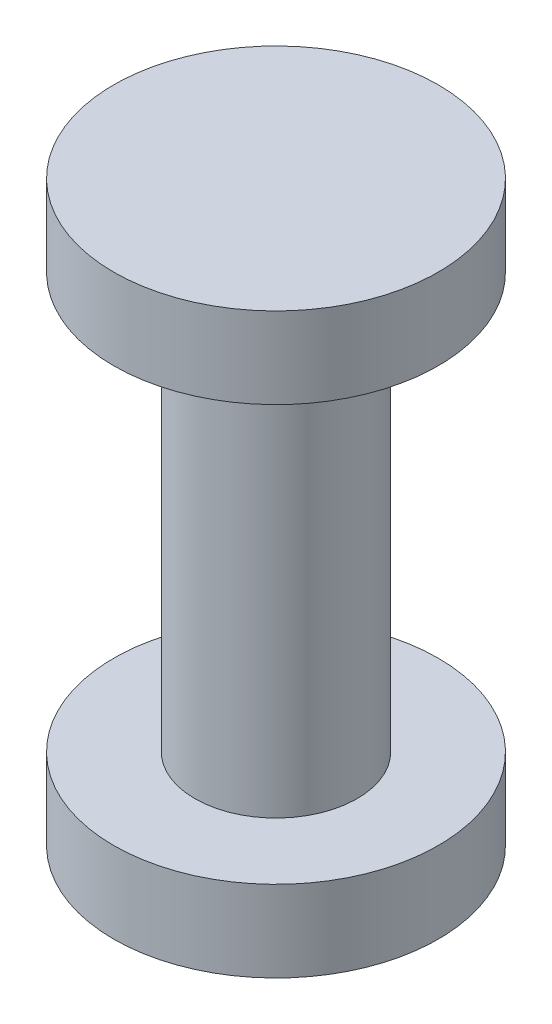
ISO-10303-21;
HEADER;
FILE_DESCRIPTION(('STEP AP214'),'2;1');
FILE_NAME('part.step','',(''),(''),'','','');
FILE_SCHEMA(('AUTOMOTIVE_DESIGN { 1 0 10303 214 1 1 1 1 }'));
ENDSEC;
DATA;
#1=APPLICATION_CONTEXT('core data for automotive mechanical design processes');
#2=APPLICATION_PROTOCOL_DEFINITION('international standard','automotive_design',2000,#1);
#3=PRODUCT_CONTEXT('',#1,'mechanical');
#4=PRODUCT('Part','Part','',(#3));
#5=PRODUCT_RELATED_PRODUCT_CATEGORY('part','',(#4));
#6=PRODUCT_DEFINITION_FORMATION('','',#4);
#7=PRODUCT_DEFINITION_CONTEXT('part definition',#1,'design');
#8=PRODUCT_DEFINITION('design','',#6,#7);
#9=PRODUCT_DEFINITION_SHAPE('','',#8);
#10=(LENGTH_UNIT() NAMED_UNIT(*) SI_UNIT(.MILLI.,.METRE.));
#11=(NAMED_UNIT(*) PLANE_ANGLE_UNIT() SI_UNIT($,.RADIAN.));
#12=(NAMED_UNIT(*) SI_UNIT($,.STERADIAN.) SOLID_ANGLE_UNIT());
#13=UNCERTAINTY_MEASURE_WITH_UNIT(LENGTH_MEASURE(1.E-05),#10,'distance_accuracy_value','');
#14=(GEOMETRIC_REPRESENTATION_CONTEXT(3) GLOBAL_UNCERTAINTY_ASSIGNED_CONTEXT((#13)) GLOBAL_UNIT_ASSIGNED_CONTEXT((#10,
#11,#12)) REPRESENTATION_CONTEXT('',''));
#15=CARTESIAN_POINT('',(0.,0.,0.));
#16=DIRECTION('',(0.,0.,1.));
#17=DIRECTION('',(1.,0.,0.));
#18=AXIS2_PLACEMENT_3D('',#15,#16,#17);
#19=CARTESIAN_POINT('',(0.,12.8,0.));
#20=DIRECTION('',(0.,-1.,0.));
#21=DIRECTION('',(0.,0.,-1.));
#22=AXIS2_PLACEMENT_3D('',#19,#20,#21);
#23=CYLINDRICAL_SURFACE('',#22,2.5);
#24=CARTESIAN_POINT('',(0.,12.8,0.));
#25=DIRECTION('',(0.,1.,0.));
#26=DIRECTION('',(0.,0.,1.));
#27=AXIS2_PLACEMENT_3D('',#24,#25,#26);
#28=CIRCLE('',#27,2.5);
#29=CARTESIAN_POINT('',(0.,12.8,2.5));
#30=VERTEX_POINT('',#29);
#31=EDGE_CURVE('E10',#30,#30,#28,.T.);
#32=ORIENTED_EDGE('',*,*,#31,.F.);
#33=EDGE_LOOP('',(#32));
#34=FACE_BOUND('',#33,.T.);
#35=CARTESIAN_POINT('',(0.,0.,0.));
#36=DIRECTION('',(0.,1.,0.));
#37=DIRECTION('',(0.,0.,1.));
#38=AXIS2_PLACEMENT_3D('',#35,#36,#37);
#39=CIRCLE('',#38,2.5);
#40=CARTESIAN_POINT('',(0.,0.,2.5));
#41=VERTEX_POINT('',#40);
#42=EDGE_CURVE('E34',#41,#41,#39,.T.);
#43=ORIENTED_EDGE('',*,*,#42,.T.);
#44=EDGE_LOOP('',(#43));
#45=FACE_BOUND('',#44,.T.);
#46=ADVANCED_FACE('F31',(#34,#45),#23,.T.);
#47=CARTESIAN_POINT('',(0.,15.3,0.));
#48=DIRECTION('',(0.,-1.,0.));
#49=DIRECTION('',(0.,0.,-1.));
#50=AXIS2_PLACEMENT_3D('',#47,#48,#49);
#51=CYLINDRICAL_SURFACE('',#50,5.);
#52=CARTESIAN_POINT('',(0.,15.3,0.));
#53=DIRECTION('',(0.,1.,0.));
#54=DIRECTION('',(0.,0.,1.));
#55=AXIS2_PLACEMENT_3D('',#52,#53,#54);
#56=CIRCLE('',#55,5.);
#57=CARTESIAN_POINT('',(0.,15.3,5.));
#58=VERTEX_POINT('',#57);
#59=EDGE_CURVE('E38',#58,#58,#56,.T.);
#60=ORIENTED_EDGE('',*,*,#59,.F.);
#61=EDGE_LOOP('',(#60));
#62=FACE_BOUND('',#61,.T.);
#63=CARTESIAN_POINT('',(0.,12.8,0.));
#64=DIRECTION('',(0.,1.,0.));
#65=DIRECTION('',(0.,0.,1.));
#66=AXIS2_PLACEMENT_3D('',#63,#64,#65);
#67=CIRCLE('',#66,5.);
#68=CARTESIAN_POINT('',(0.,12.8,5.));
#69=VERTEX_POINT('',#68);
#70=EDGE_CURVE('E42',#69,#69,#67,.T.);
#71=ORIENTED_EDGE('',*,*,#70,.T.);
#72=EDGE_LOOP('',(#71));
#73=FACE_BOUND('',#72,.T.);
#74=ADVANCED_FACE('F79',(#62,#73),#51,.T.);
#75=CARTESIAN_POINT('',(0.,15.3,0.));
#76=DIRECTION('',(0.,1.,0.));
#77=DIRECTION('',(0.,0.,1.));
#78=AXIS2_PLACEMENT_3D('',#75,#76,#77);
#79=PLANE('',#78);
#80=ORIENTED_EDGE('',*,*,#59,.T.);
#81=EDGE_LOOP('',(#80));
#82=FACE_BOUND('',#81,.T.);
#83=ADVANCED_FACE('F75',(#82),#79,.T.);
#84=CARTESIAN_POINT('',(0.,12.8,0.));
#85=DIRECTION('',(0.,1.,0.));
#86=DIRECTION('',(0.,0.,1.));
#87=AXIS2_PLACEMENT_3D('',#84,#85,#86);
#88=PLANE('',#87);
#89=ORIENTED_EDGE('',*,*,#31,.T.);
#90=EDGE_LOOP('',(#89));
#91=FACE_BOUND('',#90,.T.);
#92=ORIENTED_EDGE('',*,*,#70,.F.);
#93=EDGE_LOOP('',(#92));
#94=FACE_BOUND('',#93,.T.);
#95=ADVANCED_FACE('F67',(#91,#94),#88,.F.);
#96=CARTESIAN_POINT('',(0.,-2.5,0.));
#97=DIRECTION('',(0.,1.,0.));
#98=DIRECTION('',(0.,0.,1.));
#99=AXIS2_PLACEMENT_3D('',#96,#97,#98);
#100=CYLINDRICAL_SURFACE('',#99,5.);
#101=CARTESIAN_POINT('',(0.,-2.5,0.));
#102=DIRECTION('',(0.,-1.,0.));
#103=DIRECTION('',(0.,0.,-1.));
#104=AXIS2_PLACEMENT_3D('',#101,#102,#103);
#105=CIRCLE('',#104,5.);
#106=CARTESIAN_POINT('',(0.,-2.5,-5.));
#107=VERTEX_POINT('',#106);
#108=EDGE_CURVE('E50',#107,#107,#105,.T.);
#109=ORIENTED_EDGE('',*,*,#108,.F.);
#110=EDGE_LOOP('',(#109));
#111=FACE_BOUND('',#110,.T.);
#112=CARTESIAN_POINT('',(0.,0.,0.));
#113=DIRECTION('',(0.,-1.,0.));
#114=DIRECTION('',(0.,0.,-1.));
#115=AXIS2_PLACEMENT_3D('',#112,#113,#114);
#116=CIRCLE('',#115,5.);
#117=CARTESIAN_POINT('',(0.,0.,-5.));
#118=VERTEX_POINT('',#117);
#119=EDGE_CURVE('E47',#118,#118,#116,.T.);
#120=ORIENTED_EDGE('',*,*,#119,.T.);
#121=EDGE_LOOP('',(#120));
#122=FACE_BOUND('',#121,.T.);
#123=ADVANCED_FACE('F65',(#111,#122),#100,.T.);
#124=CARTESIAN_POINT('',(0.,-2.5,0.));
#125=DIRECTION('',(0.,-1.,0.));
#126=DIRECTION('',(0.,0.,-1.));
#127=AXIS2_PLACEMENT_3D('',#124,#125,#126);
#128=PLANE('',#127);
#129=ORIENTED_EDGE('',*,*,#108,.T.);
#130=EDGE_LOOP('',(#129));
#131=FACE_BOUND('',#130,.T.);
#132=ADVANCED_FACE('F61',(#131),#128,.T.);
#133=CARTESIAN_POINT('',(0.,0.,0.));
#134=DIRECTION('',(0.,-1.,0.));
#135=DIRECTION('',(0.,0.,-1.));
#136=AXIS2_PLACEMENT_3D('',#133,#134,#135);
#137=PLANE('',#136);
#138=ORIENTED_EDGE('',*,*,#42,.F.);
#139=EDGE_LOOP('',(#138));
#140=FACE_BOUND('',#139,.T.);
#141=ORIENTED_EDGE('',*,*,#119,.F.);
#142=EDGE_LOOP('',(#141));
#143=FACE_BOUND('',#142,.T.);
#144=ADVANCED_FACE('F58',(#140,#143),#137,.F.);
#145=CLOSED_SHELL('',(#46,#74,#83,#95,#123,#132,#144));
#146=MANIFOLD_SOLID_BREP('B2',#145);
#147=ADVANCED_BREP_SHAPE_REPRESENTATION('',(#18,#146),#14);
#148=SHAPE_DEFINITION_REPRESENTATION(#9,#147);
ENDSEC;
END-ISO-10303-21;
